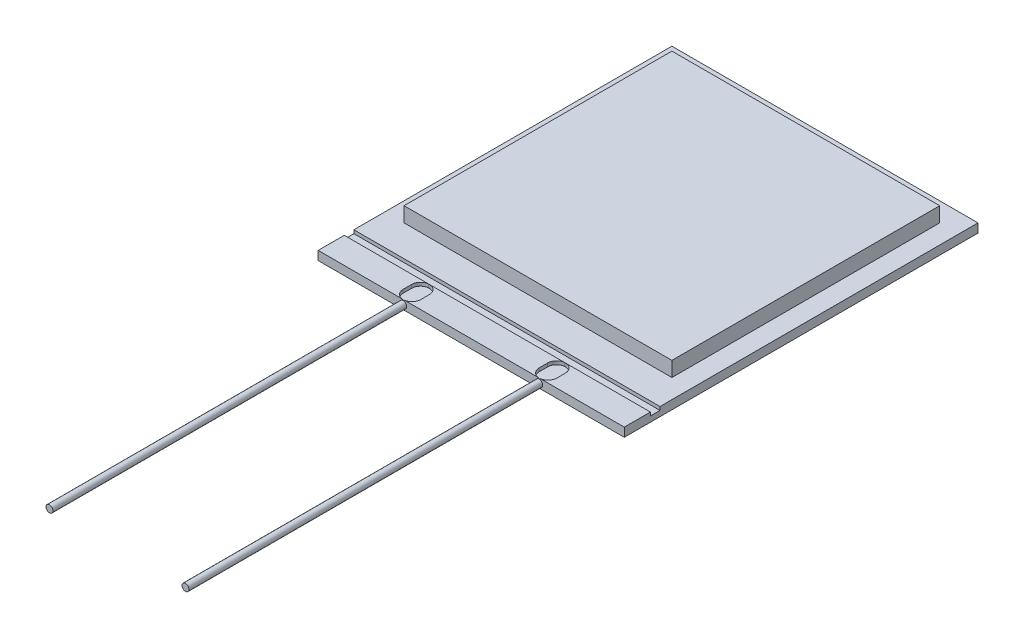
ISO-10303-21;
HEADER;
FILE_DESCRIPTION(('STEP AP214'),'2;1');
FILE_NAME('part.step','',(''),(''),'','','');
FILE_SCHEMA(('AUTOMOTIVE_DESIGN { 1 0 10303 214 1 1 1 1 }'));
ENDSEC;
DATA;
#1=APPLICATION_CONTEXT('core data for automotive mechanical design processes');
#2=APPLICATION_PROTOCOL_DEFINITION('international standard','automotive_design',2000,#1);
#3=PRODUCT_CONTEXT('',#1,'mechanical');
#4=PRODUCT('Part','Part','',(#3));
#5=PRODUCT_RELATED_PRODUCT_CATEGORY('part','',(#4));
#6=PRODUCT_DEFINITION_FORMATION('','',#4);
#7=PRODUCT_DEFINITION_CONTEXT('part definition',#1,'design');
#8=PRODUCT_DEFINITION('design','',#6,#7);
#9=PRODUCT_DEFINITION_SHAPE('','',#8);
#10=(LENGTH_UNIT() NAMED_UNIT(*) SI_UNIT(.MILLI.,.METRE.));
#11=(NAMED_UNIT(*) PLANE_ANGLE_UNIT() SI_UNIT($,.RADIAN.));
#12=(NAMED_UNIT(*) SI_UNIT($,.STERADIAN.) SOLID_ANGLE_UNIT());
#13=UNCERTAINTY_MEASURE_WITH_UNIT(LENGTH_MEASURE(1.E-05),#10,'distance_accuracy_value','');
#14=(GEOMETRIC_REPRESENTATION_CONTEXT(3) GLOBAL_UNCERTAINTY_ASSIGNED_CONTEXT((#13)) GLOBAL_UNIT_ASSIGNED_CONTEXT((#10,
#11,#12)) REPRESENTATION_CONTEXT('',''));
#15=CARTESIAN_POINT('',(0.,0.,0.));
#16=DIRECTION('',(0.,0.,1.));
#17=DIRECTION('',(1.,0.,0.));
#18=AXIS2_PLACEMENT_3D('',#15,#16,#17);
#19=CARTESIAN_POINT('',(5.715,0.3302,6.604));
#20=DIRECTION('',(0.,0.,-1.));
#21=DIRECTION('',(-1.,0.,0.));
#22=AXIS2_PLACEMENT_3D('',#19,#20,#21);
#23=PLANE('',#22);
#24=CARTESIAN_POINT('',(2.54,0.165099999999987,6.604));
#25=DIRECTION('',(0.,0.,1.));
#26=DIRECTION('',(-1.,0.,0.));
#27=AXIS2_PLACEMENT_3D('',#24,#25,#26);
#28=CIRCLE('',#27,0.129854710524441);
#29=CARTESIAN_POINT('',(2.51975239636126,0.293366442970371,6.604));
#30=VERTEX_POINT('',#29);
#31=CARTESIAN_POINT('',(2.56024760363874,0.293366442970371,6.604));
#32=VERTEX_POINT('',#31);
#33=EDGE_CURVE('E351',#30,#32,#28,.T.);
#34=ORIENTED_EDGE('',*,*,#33,.F.);
#35=DIRECTION('',(0.,1.,0.));
#36=VECTOR('',#35,1.);
#37=CARTESIAN_POINT('',(2.51975239636126,0.2032,6.604));
#38=LINE('',#37,#36);
#39=CARTESIAN_POINT('',(2.51975239636126,0.3302,6.604));
#40=VERTEX_POINT('',#39);
#41=EDGE_CURVE('E346',#30,#40,#38,.T.);
#42=ORIENTED_EDGE('',*,*,#41,.T.);
#43=DIRECTION('',(1.,0.,0.));
#44=VECTOR('',#43,1.);
#45=CARTESIAN_POINT('',(5.715,0.3302,6.604));
#46=LINE('',#45,#44);
#47=CARTESIAN_POINT('',(-2.51975239636126,0.3302,6.604));
#48=VERTEX_POINT('',#47);
#49=EDGE_CURVE('E364',#48,#40,#46,.T.);
#50=ORIENTED_EDGE('',*,*,#49,.F.);
#51=DIRECTION('',(0.,1.,0.));
#52=VECTOR('',#51,1.);
#53=CARTESIAN_POINT('',(-2.51975239636126,0.2032,6.604));
#54=LINE('',#53,#52);
#55=CARTESIAN_POINT('',(-2.51975239636126,0.293366442970384,6.604));
#56=VERTEX_POINT('',#55);
#57=EDGE_CURVE('E710',#56,#48,#54,.T.);
#58=ORIENTED_EDGE('',*,*,#57,.F.);
#59=CARTESIAN_POINT('',(-2.54,0.1651,6.604));
#60=DIRECTION('',(0.,0.,1.));
#61=DIRECTION('',(1.,0.,0.));
#62=AXIS2_PLACEMENT_3D('',#59,#60,#61);
#63=CIRCLE('',#62,0.129854710524441);
#64=CARTESIAN_POINT('',(-2.56024760363874,0.293366442970384,6.604));
#65=VERTEX_POINT('',#64);
#66=EDGE_CURVE('E13',#65,#56,#63,.T.);
#67=ORIENTED_EDGE('',*,*,#66,.F.);
#68=DIRECTION('',(0.,1.,0.));
#69=VECTOR('',#68,1.);
#70=CARTESIAN_POINT('',(-2.56024760363874,0.2032,6.604));
#71=LINE('',#70,#69);
#72=CARTESIAN_POINT('',(-2.56024760363874,0.3302,6.604));
#73=VERTEX_POINT('',#72);
#74=EDGE_CURVE('E345',#65,#73,#71,.T.);
#75=ORIENTED_EDGE('',*,*,#74,.T.);
#76=CARTESIAN_POINT('',(-5.715,0.3302,6.604));
#77=VERTEX_POINT('',#76);
#78=EDGE_CURVE('E495',#77,#73,#46,.T.);
#79=ORIENTED_EDGE('',*,*,#78,.F.);
#80=DIRECTION('',(0.,-1.,0.));
#81=VECTOR('',#80,1.);
#82=CARTESIAN_POINT('',(-5.715,0.3302,6.604));
#83=LINE('',#82,#81);
#84=CARTESIAN_POINT('',(-5.715,0.,6.604));
#85=VERTEX_POINT('',#84);
#86=EDGE_CURVE('E513',#77,#85,#83,.T.);
#87=ORIENTED_EDGE('',*,*,#86,.T.);
#88=DIRECTION('',(1.,0.,0.));
#89=VECTOR('',#88,1.);
#90=CARTESIAN_POINT('',(5.715,0.,6.604));
#91=LINE('',#90,#89);
#92=CARTESIAN_POINT('',(5.715,0.,6.604));
#93=VERTEX_POINT('',#92);
#94=EDGE_CURVE('E510',#85,#93,#91,.T.);
#95=ORIENTED_EDGE('',*,*,#94,.T.);
#96=DIRECTION('',(0.,-1.,0.));
#97=VECTOR('',#96,1.);
#98=CARTESIAN_POINT('',(5.715,0.3302,6.604));
#99=LINE('',#98,#97);
#100=CARTESIAN_POINT('',(5.715,0.3302,6.604));
#101=VERTEX_POINT('',#100);
#102=EDGE_CURVE('E451',#101,#93,#99,.T.);
#103=ORIENTED_EDGE('',*,*,#102,.F.);
#104=CARTESIAN_POINT('',(2.56024760363874,0.3302,6.604));
#105=VERTEX_POINT('',#104);
#106=EDGE_CURVE('E499',#105,#101,#46,.T.);
#107=ORIENTED_EDGE('',*,*,#106,.F.);
#108=DIRECTION('',(0.,1.,0.));
#109=VECTOR('',#108,1.);
#110=CARTESIAN_POINT('',(2.56024760363874,0.2032,6.604));
#111=LINE('',#110,#109);
#112=EDGE_CURVE('E358',#32,#105,#111,.T.);
#113=ORIENTED_EDGE('',*,*,#112,.F.);
#114=EDGE_LOOP('',(#34,#42,#50,#58,#67,#75,#79,#87,#95,#103,#107,#113));
#115=FACE_BOUND('',#114,.T.);
#116=ADVANCED_FACE('F141',(#115),#23,.F.);
#117=CARTESIAN_POINT('',(-5.715,0.3302,-6.604));
#118=DIRECTION('',(0.,1.,0.));
#119=DIRECTION('',(0.,0.,1.));
#120=AXIS2_PLACEMENT_3D('',#117,#118,#119);
#121=PLANE('',#120);
#122=DIRECTION('',(1.,0.,0.));
#123=VECTOR('',#122,1.);
#124=CARTESIAN_POINT('',(-13.7275605878218,0.3302,5.62864));
#125=LINE('',#124,#123);
#126=CARTESIAN_POINT('',(2.56511819770641,0.3302,5.62864));
#127=VERTEX_POINT('',#126);
#128=CARTESIAN_POINT('',(5.715,0.3302,5.62864));
#129=VERTEX_POINT('',#128);
#130=EDGE_CURVE('E389',#127,#129,#125,.T.);
#131=ORIENTED_EDGE('',*,*,#130,.F.);
#132=CARTESIAN_POINT('',(2.54,0.3302,5.95788324768168));
#133=DIRECTION('',(0.,1.,0.));
#134=DIRECTION('',(0.,0.,1.));
#135=AXIS2_PLACEMENT_3D('',#132,#133,#134);
#136=CIRCLE('',#135,0.3302);
#137=CARTESIAN_POINT('',(2.8702,0.3302,5.95788324768168));
#138=VERTEX_POINT('',#137);
#139=EDGE_CURVE('E561',#127,#138,#136,.F.);
#140=ORIENTED_EDGE('',*,*,#139,.T.);
#141=DIRECTION('',(0.,0.,-1.));
#142=VECTOR('',#141,1.);
#143=CARTESIAN_POINT('',(2.8702,0.3302,0.));
#144=LINE('',#143,#142);
#145=CARTESIAN_POINT('',(2.8702,0.3302,6.27442136818827));
#146=VERTEX_POINT('',#145);
#147=EDGE_CURVE('E570',#146,#138,#144,.T.);
#148=ORIENTED_EDGE('',*,*,#147,.F.);
#149=CARTESIAN_POINT('',(2.54,0.3302,6.27442136818827));
#150=DIRECTION('',(0.,1.,0.));
#151=DIRECTION('',(0.,0.,1.));
#152=AXIS2_PLACEMENT_3D('',#149,#150,#151);
#153=CIRCLE('',#152,0.3302);
#154=EDGE_CURVE('E366',#146,#105,#153,.F.);
#155=ORIENTED_EDGE('',*,*,#154,.T.);
#156=ORIENTED_EDGE('',*,*,#106,.T.);
#157=DIRECTION('',(0.,0.,-1.));
#158=VECTOR('',#157,1.);
#159=CARTESIAN_POINT('',(5.715,0.3302,6.604));
#160=LINE('',#159,#158);
#161=EDGE_CURVE('E500',#101,#129,#160,.T.);
#162=ORIENTED_EDGE('',*,*,#161,.T.);
#163=EDGE_LOOP('',(#131,#140,#148,#155,#156,#162));
#164=FACE_BOUND('',#163,.T.);
#165=ADVANCED_FACE('F602',(#164),#121,.T.);
#166=DIRECTION('',(0.,0.,-1.));
#167=VECTOR('',#166,1.);
#168=CARTESIAN_POINT('',(2.2098,0.3302,0.));
#169=LINE('',#168,#167);
#170=CARTESIAN_POINT('',(2.2098,0.3302,6.27442136818827));
#171=VERTEX_POINT('',#170);
#172=CARTESIAN_POINT('',(2.2098,0.3302,5.95788324768168));
#173=VERTEX_POINT('',#172);
#174=EDGE_CURVE('E503',#171,#173,#169,.T.);
#175=ORIENTED_EDGE('',*,*,#174,.T.);
#176=CARTESIAN_POINT('',(2.51488180229359,0.3302,5.62864));
#177=VERTEX_POINT('',#176);
#178=EDGE_CURVE('E558',#173,#177,#136,.F.);
#179=ORIENTED_EDGE('',*,*,#178,.T.);
#180=CARTESIAN_POINT('',(-2.51488180229358,0.3302,5.62864));
#181=VERTEX_POINT('',#180);
#182=EDGE_CURVE('E400',#181,#177,#125,.T.);
#183=ORIENTED_EDGE('',*,*,#182,.F.);
#184=CARTESIAN_POINT('',(-2.54,0.3302,5.95788324768168));
#185=DIRECTION('',(0.,1.,0.));
#186=DIRECTION('',(0.,0.,1.));
#187=AXIS2_PLACEMENT_3D('',#184,#185,#186);
#188=CIRCLE('',#187,0.3302);
#189=CARTESIAN_POINT('',(-2.2098,0.3302,5.95788324768168));
#190=VERTEX_POINT('',#189);
#191=EDGE_CURVE('E398',#190,#181,#188,.T.);
#192=ORIENTED_EDGE('',*,*,#191,.F.);
#193=DIRECTION('',(0.,0.,-1.));
#194=VECTOR('',#193,1.);
#195=CARTESIAN_POINT('',(-2.2098,0.3302,0.));
#196=LINE('',#195,#194);
#197=CARTESIAN_POINT('',(-2.2098,0.3302,6.27442136818827));
#198=VERTEX_POINT('',#197);
#199=EDGE_CURVE('E527',#198,#190,#196,.T.);
#200=ORIENTED_EDGE('',*,*,#199,.F.);
#201=CARTESIAN_POINT('',(-2.54,0.3302,6.27442136818827));
#202=DIRECTION('',(0.,1.,0.));
#203=DIRECTION('',(0.,0.,1.));
#204=AXIS2_PLACEMENT_3D('',#201,#202,#203);
#205=CIRCLE('',#204,0.3302);
#206=EDGE_CURVE('E711',#48,#198,#205,.T.);
#207=ORIENTED_EDGE('',*,*,#206,.F.);
#208=ORIENTED_EDGE('',*,*,#49,.T.);
#209=EDGE_CURVE('E362',#40,#171,#153,.F.);
#210=ORIENTED_EDGE('',*,*,#209,.T.);
#211=EDGE_LOOP('',(#175,#179,#183,#192,#200,#207,#208,#210));
#212=FACE_BOUND('',#211,.T.);
#213=ADVANCED_FACE('F607',(#212),#121,.T.);
#214=CARTESIAN_POINT('',(-2.8702,0.3302,6.27442136818827));
#215=VERTEX_POINT('',#214);
#216=EDGE_CURVE('E705',#215,#73,#205,.T.);
#217=ORIENTED_EDGE('',*,*,#216,.F.);
#218=DIRECTION('',(0.,0.,-1.));
#219=VECTOR('',#218,1.);
#220=CARTESIAN_POINT('',(-2.8702,0.3302,0.));
#221=LINE('',#220,#219);
#222=CARTESIAN_POINT('',(-2.8702,0.3302,5.95788324768168));
#223=VERTEX_POINT('',#222);
#224=EDGE_CURVE('E512',#215,#223,#221,.T.);
#225=ORIENTED_EDGE('',*,*,#224,.T.);
#226=CARTESIAN_POINT('',(-2.56511819770642,0.3302,5.62864));
#227=VERTEX_POINT('',#226);
#228=EDGE_CURVE('E399',#227,#223,#188,.T.);
#229=ORIENTED_EDGE('',*,*,#228,.F.);
#230=CARTESIAN_POINT('',(-5.715,0.3302,5.62864));
#231=VERTEX_POINT('',#230);
#232=EDGE_CURVE('E403',#231,#227,#125,.T.);
#233=ORIENTED_EDGE('',*,*,#232,.F.);
#234=DIRECTION('',(0.,0.,1.));
#235=VECTOR('',#234,1.);
#236=CARTESIAN_POINT('',(-5.715,0.3302,6.604));
#237=LINE('',#236,#235);
#238=EDGE_CURVE('E496',#231,#77,#237,.T.);
#239=ORIENTED_EDGE('',*,*,#238,.T.);
#240=ORIENTED_EDGE('',*,*,#78,.T.);
#241=EDGE_LOOP('',(#217,#225,#229,#233,#239,#240));
#242=FACE_BOUND('',#241,.T.);
#243=ADVANCED_FACE('F699',(#242),#121,.T.);
#244=DIRECTION('',(1.,0.,0.));
#245=VECTOR('',#244,1.);
#246=CARTESIAN_POINT('',(5.0000027,0.3302,4.1110027));
#247=LINE('',#246,#245);
#248=CARTESIAN_POINT('',(-5.0000027,0.3302,4.1110027));
#249=VERTEX_POINT('',#248);
#250=CARTESIAN_POINT('',(5.0000027,0.3302,4.1110027));
#251=VERTEX_POINT('',#250);
#252=EDGE_CURVE('E476',#249,#251,#247,.T.);
#253=ORIENTED_EDGE('',*,*,#252,.F.);
#254=DIRECTION('',(0.,0.,1.));
#255=VECTOR('',#254,1.);
#256=CARTESIAN_POINT('',(-5.0000027,0.3302,4.1110027));
#257=LINE('',#256,#255);
#258=CARTESIAN_POINT('',(-5.0000027,0.3302,-5.8890027));
#259=VERTEX_POINT('',#258);
#260=EDGE_CURVE('E471',#259,#249,#257,.T.);
#261=ORIENTED_EDGE('',*,*,#260,.F.);
#262=DIRECTION('',(-1.,0.,0.));
#263=VECTOR('',#262,1.);
#264=CARTESIAN_POINT('',(5.0000027,0.3302,-5.8890027));
#265=LINE('',#264,#263);
#266=CARTESIAN_POINT('',(5.0000027,0.3302,-5.8890027));
#267=VERTEX_POINT('',#266);
#268=EDGE_CURVE('E483',#267,#259,#265,.T.);
#269=ORIENTED_EDGE('',*,*,#268,.F.);
#270=DIRECTION('',(0.,0.,-1.));
#271=VECTOR('',#270,1.);
#272=CARTESIAN_POINT('',(5.0000027,0.3302,4.1110027));
#273=LINE('',#272,#271);
#274=EDGE_CURVE('E479',#251,#267,#273,.T.);
#275=ORIENTED_EDGE('',*,*,#274,.F.);
#276=EDGE_LOOP('',(#253,#261,#269,#275));
#277=FACE_BOUND('',#276,.T.);
#278=CARTESIAN_POINT('',(-5.715,0.3302,-6.604));
#279=VERTEX_POINT('',#278);
#280=CARTESIAN_POINT('',(-5.715,0.3302,5.2705));
#281=VERTEX_POINT('',#280);
#282=EDGE_CURVE('E492',#279,#281,#237,.T.);
#283=ORIENTED_EDGE('',*,*,#282,.T.);
#284=DIRECTION('',(1.,0.,0.));
#285=VECTOR('',#284,1.);
#286=CARTESIAN_POINT('',(-13.7275605878218,0.3302,5.2705));
#287=LINE('',#286,#285);
#288=CARTESIAN_POINT('',(5.715,0.3302,5.2705));
#289=VERTEX_POINT('',#288);
#290=EDGE_CURVE('E415',#281,#289,#287,.T.);
#291=ORIENTED_EDGE('',*,*,#290,.T.);
#292=CARTESIAN_POINT('',(5.715,0.3302,-6.604));
#293=VERTEX_POINT('',#292);
#294=EDGE_CURVE('E504',#289,#293,#160,.T.);
#295=ORIENTED_EDGE('',*,*,#294,.T.);
#296=DIRECTION('',(-1.,0.,0.));
#297=VECTOR('',#296,1.);
#298=CARTESIAN_POINT('',(5.715,0.3302,-6.604));
#299=LINE('',#298,#297);
#300=EDGE_CURVE('E452',#293,#279,#299,.T.);
#301=ORIENTED_EDGE('',*,*,#300,.T.);
#302=EDGE_LOOP('',(#283,#291,#295,#301));
#303=FACE_BOUND('',#302,.T.);
#304=ADVANCED_FACE('F610',(#277,#303),#121,.T.);
#305=CARTESIAN_POINT('',(5.715,0.3302,6.604));
#306=DIRECTION('',(-1.,0.,0.));
#307=DIRECTION('',(0.,0.,1.));
#308=AXIS2_PLACEMENT_3D('',#305,#306,#307);
#309=PLANE('',#308);
#310=DIRECTION('',(0.,1.,0.));
#311=VECTOR('',#310,1.);
#312=CARTESIAN_POINT('',(5.715,0.2032,5.2705));
#313=LINE('',#312,#311);
#314=CARTESIAN_POINT('',(5.715,0.2032,5.2705));
#315=VERTEX_POINT('',#314);
#316=EDGE_CURVE('E421',#315,#289,#313,.T.);
#317=ORIENTED_EDGE('',*,*,#316,.F.);
#318=DIRECTION('',(0.,0.,-1.));
#319=VECTOR('',#318,1.);
#320=CARTESIAN_POINT('',(5.715,0.2032,0.));
#321=LINE('',#320,#319);
#322=CARTESIAN_POINT('',(5.715,0.2032,5.62864));
#323=VERTEX_POINT('',#322);
#324=EDGE_CURVE('E425',#323,#315,#321,.T.);
#325=ORIENTED_EDGE('',*,*,#324,.F.);
#326=DIRECTION('',(0.,1.,0.));
#327=VECTOR('',#326,1.);
#328=CARTESIAN_POINT('',(5.715,0.2032,5.62864));
#329=LINE('',#328,#327);
#330=EDGE_CURVE('E449',#323,#129,#329,.T.);
#331=ORIENTED_EDGE('',*,*,#330,.T.);
#332=ORIENTED_EDGE('',*,*,#161,.F.);
#333=ORIENTED_EDGE('',*,*,#102,.T.);
#334=DIRECTION('',(0.,0.,-1.));
#335=VECTOR('',#334,1.);
#336=CARTESIAN_POINT('',(5.715,0.,6.604));
#337=LINE('',#336,#335);
#338=CARTESIAN_POINT('',(5.715,0.,-6.604));
#339=VERTEX_POINT('',#338);
#340=EDGE_CURVE('E447',#93,#339,#337,.T.);
#341=ORIENTED_EDGE('',*,*,#340,.T.);
#342=DIRECTION('',(0.,-1.,0.));
#343=VECTOR('',#342,1.);
#344=CARTESIAN_POINT('',(5.715,0.3302,-6.604));
#345=LINE('',#344,#343);
#346=EDGE_CURVE('E475',#293,#339,#345,.T.);
#347=ORIENTED_EDGE('',*,*,#346,.F.);
#348=ORIENTED_EDGE('',*,*,#294,.F.);
#349=EDGE_LOOP('',(#317,#325,#331,#332,#333,#341,#347,#348));
#350=FACE_BOUND('',#349,.T.);
#351=ADVANCED_FACE('F613',(#350),#309,.F.);
#352=CARTESIAN_POINT('',(-5.715,0.3302,6.604));
#353=DIRECTION('',(1.,0.,0.));
#354=DIRECTION('',(0.,0.,-1.));
#355=AXIS2_PLACEMENT_3D('',#352,#353,#354);
#356=PLANE('',#355);
#357=ORIENTED_EDGE('',*,*,#238,.F.);
#358=DIRECTION('',(0.,1.,0.));
#359=VECTOR('',#358,1.);
#360=CARTESIAN_POINT('',(-5.715,0.2032,5.62864));
#361=LINE('',#360,#359);
#362=CARTESIAN_POINT('',(-5.715,0.2032,5.62864));
#363=VERTEX_POINT('',#362);
#364=EDGE_CURVE('E406',#363,#231,#361,.T.);
#365=ORIENTED_EDGE('',*,*,#364,.F.);
#366=DIRECTION('',(0.,0.,1.));
#367=VECTOR('',#366,1.);
#368=CARTESIAN_POINT('',(-5.715,0.2032,0.));
#369=LINE('',#368,#367);
#370=CARTESIAN_POINT('',(-5.715,0.2032,5.2705));
#371=VERTEX_POINT('',#370);
#372=EDGE_CURVE('E413',#371,#363,#369,.T.);
#373=ORIENTED_EDGE('',*,*,#372,.F.);
#374=DIRECTION('',(0.,1.,0.));
#375=VECTOR('',#374,1.);
#376=CARTESIAN_POINT('',(-5.715,0.2032,5.2705));
#377=LINE('',#376,#375);
#378=EDGE_CURVE('E444',#371,#281,#377,.T.);
#379=ORIENTED_EDGE('',*,*,#378,.T.);
#380=ORIENTED_EDGE('',*,*,#282,.F.);
#381=DIRECTION('',(0.,-1.,0.));
#382=VECTOR('',#381,1.);
#383=CARTESIAN_POINT('',(-5.715,0.3302,-6.604));
#384=LINE('',#383,#382);
#385=CARTESIAN_POINT('',(-5.715,0.,-6.604));
#386=VERTEX_POINT('',#385);
#387=EDGE_CURVE('E446',#279,#386,#384,.T.);
#388=ORIENTED_EDGE('',*,*,#387,.T.);
#389=DIRECTION('',(0.,0.,1.));
#390=VECTOR('',#389,1.);
#391=CARTESIAN_POINT('',(-5.715,0.,6.604));
#392=LINE('',#391,#390);
#393=EDGE_CURVE('E506',#386,#85,#392,.T.);
#394=ORIENTED_EDGE('',*,*,#393,.T.);
#395=ORIENTED_EDGE('',*,*,#86,.F.);
#396=EDGE_LOOP('',(#357,#365,#373,#379,#380,#388,#394,#395));
#397=FACE_BOUND('',#396,.T.);
#398=ADVANCED_FACE('F615',(#397),#356,.F.);
#399=CARTESIAN_POINT('',(5.715,0.3302,-6.604));
#400=DIRECTION('',(0.,0.,1.));
#401=DIRECTION('',(1.,0.,0.));
#402=AXIS2_PLACEMENT_3D('',#399,#400,#401);
#403=PLANE('',#402);
#404=DIRECTION('',(-1.,0.,0.));
#405=VECTOR('',#404,1.);
#406=CARTESIAN_POINT('',(5.715,0.,-6.604));
#407=LINE('',#406,#405);
#408=EDGE_CURVE('E509',#339,#386,#407,.T.);
#409=ORIENTED_EDGE('',*,*,#408,.T.);
#410=ORIENTED_EDGE('',*,*,#387,.F.);
#411=ORIENTED_EDGE('',*,*,#300,.F.);
#412=ORIENTED_EDGE('',*,*,#346,.T.);
#413=EDGE_LOOP('',(#409,#410,#411,#412));
#414=FACE_BOUND('',#413,.T.);
#415=ADVANCED_FACE('F618',(#414),#403,.F.);
#416=CARTESIAN_POINT('',(-5.715,0.,-6.604));
#417=DIRECTION('',(0.,1.,0.));
#418=DIRECTION('',(0.,0.,1.));
#419=AXIS2_PLACEMENT_3D('',#416,#417,#418);
#420=PLANE('',#419);
#421=ORIENTED_EDGE('',*,*,#393,.F.);
#422=ORIENTED_EDGE('',*,*,#408,.F.);
#423=ORIENTED_EDGE('',*,*,#340,.F.);
#424=ORIENTED_EDGE('',*,*,#94,.F.);
#425=EDGE_LOOP('',(#421,#422,#423,#424));
#426=FACE_BOUND('',#425,.T.);
#427=ADVANCED_FACE('F674',(#426),#420,.F.);
#428=CARTESIAN_POINT('',(-5.0000027,0.885825,4.1110027));
#429=DIRECTION('',(1.,0.,0.));
#430=DIRECTION('',(0.,0.,-1.));
#431=AXIS2_PLACEMENT_3D('',#428,#429,#430);
#432=PLANE('',#431);
#433=ORIENTED_EDGE('',*,*,#260,.T.);
#434=DIRECTION('',(0.,-1.,0.));
#435=VECTOR('',#434,1.);
#436=CARTESIAN_POINT('',(-5.0000027,0.885825,4.1110027));
#437=LINE('',#436,#435);
#438=CARTESIAN_POINT('',(-5.0000027,0.885825,4.1110027));
#439=VERTEX_POINT('',#438);
#440=EDGE_CURVE('E478',#439,#249,#437,.T.);
#441=ORIENTED_EDGE('',*,*,#440,.F.);
#442=DIRECTION('',(0.,0.,1.));
#443=VECTOR('',#442,1.);
#444=CARTESIAN_POINT('',(-5.0000027,0.885825,4.1110027));
#445=LINE('',#444,#443);
#446=CARTESIAN_POINT('',(-5.0000027,0.885825,-5.8890027));
#447=VERTEX_POINT('',#446);
#448=EDGE_CURVE('E426',#447,#439,#445,.T.);
#449=ORIENTED_EDGE('',*,*,#448,.F.);
#450=DIRECTION('',(0.,-1.,0.));
#451=VECTOR('',#450,1.);
#452=CARTESIAN_POINT('',(-5.0000027,0.885825,-5.8890027));
#453=LINE('',#452,#451);
#454=EDGE_CURVE('E474',#447,#259,#453,.T.);
#455=ORIENTED_EDGE('',*,*,#454,.T.);
#456=EDGE_LOOP('',(#433,#441,#449,#455));
#457=FACE_BOUND('',#456,.T.);
#458=ADVANCED_FACE('F935',(#457),#432,.F.);
#459=CARTESIAN_POINT('',(5.0000027,0.885825,4.1110027));
#460=DIRECTION('',(0.,0.,-1.));
#461=DIRECTION('',(-1.,0.,0.));
#462=AXIS2_PLACEMENT_3D('',#459,#460,#461);
#463=PLANE('',#462);
#464=ORIENTED_EDGE('',*,*,#252,.T.);
#465=DIRECTION('',(0.,-1.,0.));
#466=VECTOR('',#465,1.);
#467=CARTESIAN_POINT('',(5.0000027,0.885825,4.1110027));
#468=LINE('',#467,#466);
#469=CARTESIAN_POINT('',(5.0000027,0.885825,4.1110027));
#470=VERTEX_POINT('',#469);
#471=EDGE_CURVE('E482',#470,#251,#468,.T.);
#472=ORIENTED_EDGE('',*,*,#471,.F.);
#473=DIRECTION('',(1.,0.,0.));
#474=VECTOR('',#473,1.);
#475=CARTESIAN_POINT('',(5.0000027,0.885825,4.1110027));
#476=LINE('',#475,#474);
#477=EDGE_CURVE('E468',#439,#470,#476,.T.);
#478=ORIENTED_EDGE('',*,*,#477,.F.);
#479=ORIENTED_EDGE('',*,*,#440,.T.);
#480=EDGE_LOOP('',(#464,#472,#478,#479));
#481=FACE_BOUND('',#480,.T.);
#482=ADVANCED_FACE('F925',(#481),#463,.F.);
#483=CARTESIAN_POINT('',(5.0000027,0.885825,4.1110027));
#484=DIRECTION('',(-1.,0.,0.));
#485=DIRECTION('',(0.,0.,1.));
#486=AXIS2_PLACEMENT_3D('',#483,#484,#485);
#487=PLANE('',#486);
#488=ORIENTED_EDGE('',*,*,#274,.T.);
#489=DIRECTION('',(0.,-1.,0.));
#490=VECTOR('',#489,1.);
#491=CARTESIAN_POINT('',(5.0000027,0.885825,-5.8890027));
#492=LINE('',#491,#490);
#493=CARTESIAN_POINT('',(5.0000027,0.885825,-5.8890027));
#494=VERTEX_POINT('',#493);
#495=EDGE_CURVE('E485',#494,#267,#492,.T.);
#496=ORIENTED_EDGE('',*,*,#495,.F.);
#497=DIRECTION('',(0.,0.,-1.));
#498=VECTOR('',#497,1.);
#499=CARTESIAN_POINT('',(5.0000027,0.885825,4.1110027));
#500=LINE('',#499,#498);
#501=EDGE_CURVE('E462',#470,#494,#500,.T.);
#502=ORIENTED_EDGE('',*,*,#501,.F.);
#503=ORIENTED_EDGE('',*,*,#471,.T.);
#504=EDGE_LOOP('',(#488,#496,#502,#503));
#505=FACE_BOUND('',#504,.T.);
#506=ADVANCED_FACE('F915',(#505),#487,.F.);
#507=CARTESIAN_POINT('',(5.0000027,0.885825,-5.8890027));
#508=DIRECTION('',(0.,0.,1.));
#509=DIRECTION('',(1.,0.,0.));
#510=AXIS2_PLACEMENT_3D('',#507,#508,#509);
#511=PLANE('',#510);
#512=ORIENTED_EDGE('',*,*,#268,.T.);
#513=ORIENTED_EDGE('',*,*,#454,.F.);
#514=DIRECTION('',(-1.,0.,0.));
#515=VECTOR('',#514,1.);
#516=CARTESIAN_POINT('',(5.0000027,0.885825,-5.8890027));
#517=LINE('',#516,#515);
#518=EDGE_CURVE('E459',#494,#447,#517,.T.);
#519=ORIENTED_EDGE('',*,*,#518,.F.);
#520=ORIENTED_EDGE('',*,*,#495,.T.);
#521=EDGE_LOOP('',(#512,#513,#519,#520));
#522=FACE_BOUND('',#521,.T.);
#523=ADVANCED_FACE('F651',(#522),#511,.F.);
#524=CARTESIAN_POINT('',(-5.0000027,0.885825,-5.8890027));
#525=DIRECTION('',(0.,1.,0.));
#526=DIRECTION('',(0.,0.,1.));
#527=AXIS2_PLACEMENT_3D('',#524,#525,#526);
#528=PLANE('',#527);
#529=ORIENTED_EDGE('',*,*,#448,.T.);
#530=ORIENTED_EDGE('',*,*,#477,.T.);
#531=ORIENTED_EDGE('',*,*,#501,.T.);
#532=ORIENTED_EDGE('',*,*,#518,.T.);
#533=EDGE_LOOP('',(#529,#530,#531,#532));
#534=FACE_BOUND('',#533,.T.);
#535=ADVANCED_FACE('F643',(#534),#528,.T.);
#536=CARTESIAN_POINT('',(-13.7275605878218,0.2032,5.62864));
#537=DIRECTION('',(0.,0.,1.));
#538=DIRECTION('',(1.,0.,0.));
#539=AXIS2_PLACEMENT_3D('',#536,#537,#538);
#540=PLANE('',#539);
#541=ORIENTED_EDGE('',*,*,#182,.T.);
#542=DIRECTION('',(0.,1.,0.));
#543=VECTOR('',#542,1.);
#544=CARTESIAN_POINT('',(2.51488180229359,0.2032,5.62864));
#545=LINE('',#544,#543);
#546=CARTESIAN_POINT('',(2.51488180229359,0.2032,5.62864));
#547=VERTEX_POINT('',#546);
#548=EDGE_CURVE('E150',#547,#177,#545,.T.);
#549=ORIENTED_EDGE('',*,*,#548,.F.);
#550=DIRECTION('',(1.,0.,0.));
#551=VECTOR('',#550,1.);
#552=CARTESIAN_POINT('',(-13.7275605878218,0.2032,5.62864));
#553=LINE('',#552,#551);
#554=CARTESIAN_POINT('',(-2.51488180229358,0.2032,5.62864));
#555=VERTEX_POINT('',#554);
#556=EDGE_CURVE('E388',#555,#547,#553,.T.);
#557=ORIENTED_EDGE('',*,*,#556,.F.);
#558=DIRECTION('',(0.,1.,0.));
#559=VECTOR('',#558,1.);
#560=CARTESIAN_POINT('',(-2.51488180229358,0.2032,5.62864));
#561=LINE('',#560,#559);
#562=EDGE_CURVE('E407',#555,#181,#561,.T.);
#563=ORIENTED_EDGE('',*,*,#562,.T.);
#564=EDGE_LOOP('',(#541,#549,#557,#563));
#565=FACE_BOUND('',#564,.T.);
#566=ADVANCED_FACE('F640',(#565),#540,.F.);
#567=ORIENTED_EDGE('',*,*,#232,.T.);
#568=DIRECTION('',(0.,1.,0.));
#569=VECTOR('',#568,1.);
#570=CARTESIAN_POINT('',(-2.56511819770642,0.2032,5.62864));
#571=LINE('',#570,#569);
#572=CARTESIAN_POINT('',(-2.56511819770642,0.2032,5.62864));
#573=VERTEX_POINT('',#572);
#574=EDGE_CURVE('E395',#573,#227,#571,.T.);
#575=ORIENTED_EDGE('',*,*,#574,.F.);
#576=EDGE_CURVE('E422',#363,#573,#553,.T.);
#577=ORIENTED_EDGE('',*,*,#576,.F.);
#578=ORIENTED_EDGE('',*,*,#364,.T.);
#579=EDGE_LOOP('',(#567,#575,#577,#578));
#580=FACE_BOUND('',#579,.T.);
#581=ADVANCED_FACE('F642',(#580),#540,.F.);
#582=CARTESIAN_POINT('',(-13.7275605878218,0.2032,5.2705));
#583=DIRECTION('',(0.,0.,1.));
#584=DIRECTION('',(1.,0.,0.));
#585=AXIS2_PLACEMENT_3D('',#582,#583,#584);
#586=PLANE('',#585);
#587=ORIENTED_EDGE('',*,*,#290,.F.);
#588=ORIENTED_EDGE('',*,*,#378,.F.);
#589=DIRECTION('',(1.,0.,0.));
#590=VECTOR('',#589,1.);
#591=CARTESIAN_POINT('',(-13.7275605878218,0.2032,5.2705));
#592=LINE('',#591,#590);
#593=EDGE_CURVE('E436',#371,#315,#592,.T.);
#594=ORIENTED_EDGE('',*,*,#593,.T.);
#595=ORIENTED_EDGE('',*,*,#316,.T.);
#596=EDGE_LOOP('',(#587,#588,#594,#595));
#597=FACE_BOUND('',#596,.T.);
#598=ADVANCED_FACE('F650',(#597),#586,.T.);
#599=ORIENTED_EDGE('',*,*,#130,.T.);
#600=ORIENTED_EDGE('',*,*,#330,.F.);
#601=CARTESIAN_POINT('',(2.56511819770641,0.2032,5.62864));
#602=VERTEX_POINT('',#601);
#603=EDGE_CURVE('E423',#602,#323,#553,.T.);
#604=ORIENTED_EDGE('',*,*,#603,.F.);
#605=DIRECTION('',(0.,1.,0.));
#606=VECTOR('',#605,1.);
#607=CARTESIAN_POINT('',(2.56511819770641,0.2032,5.62864));
#608=LINE('',#607,#606);
#609=EDGE_CURVE('E385',#602,#127,#608,.T.);
#610=ORIENTED_EDGE('',*,*,#609,.T.);
#611=EDGE_LOOP('',(#599,#600,#604,#610));
#612=FACE_BOUND('',#611,.T.);
#613=ADVANCED_FACE('F645',(#612),#540,.F.);
#614=CARTESIAN_POINT('',(-13.7275605878218,0.2032,0.));
#615=DIRECTION('',(0.,1.,0.));
#616=DIRECTION('',(0.,0.,1.));
#617=AXIS2_PLACEMENT_3D('',#614,#615,#616);
#618=PLANE('',#617);
#619=ORIENTED_EDGE('',*,*,#556,.T.);
#620=CARTESIAN_POINT('',(2.54,0.2032,5.95788324768168));
#621=DIRECTION('',(0.,1.,0.));
#622=DIRECTION('',(0.,0.,1.));
#623=AXIS2_PLACEMENT_3D('',#620,#621,#622);
#624=CIRCLE('',#623,0.3302);
#625=CARTESIAN_POINT('',(2.2098,0.2032,5.95788324768168));
#626=VERTEX_POINT('',#625);
#627=EDGE_CURVE('E381',#626,#547,#624,.F.);
#628=ORIENTED_EDGE('',*,*,#627,.F.);
#629=DIRECTION('',(0.,0.,-1.));
#630=VECTOR('',#629,1.);
#631=CARTESIAN_POINT('',(2.2098,0.2032,0.));
#632=LINE('',#631,#630);
#633=CARTESIAN_POINT('',(2.2098,0.2032,6.27442136818827));
#634=VERTEX_POINT('',#633);
#635=EDGE_CURVE('E376',#634,#626,#632,.T.);
#636=ORIENTED_EDGE('',*,*,#635,.F.);
#637=CARTESIAN_POINT('',(2.54,0.2032,6.27442136818827));
#638=DIRECTION('',(0.,1.,0.));
#639=DIRECTION('',(0.,0.,1.));
#640=AXIS2_PLACEMENT_3D('',#637,#638,#639);
#641=CIRCLE('',#640,0.3302);
#642=CARTESIAN_POINT('',(2.51975239636126,0.2032,6.604));
#643=VERTEX_POINT('',#642);
#644=EDGE_CURVE('E374',#643,#634,#641,.F.);
#645=ORIENTED_EDGE('',*,*,#644,.F.);
#646=DIRECTION('',(1.,0.,0.));
#647=VECTOR('',#646,1.);
#648=CARTESIAN_POINT('',(-13.7275605878218,0.2032,6.604));
#649=LINE('',#648,#647);
#650=CARTESIAN_POINT('',(2.56024760363874,0.2032,6.604));
#651=VERTEX_POINT('',#650);
#652=EDGE_CURVE('E341',#643,#651,#649,.T.);
#653=ORIENTED_EDGE('',*,*,#652,.T.);
#654=CARTESIAN_POINT('',(2.8702,0.2032,6.27442136818827));
#655=VERTEX_POINT('',#654);
#656=EDGE_CURVE('E373',#655,#651,#641,.F.);
#657=ORIENTED_EDGE('',*,*,#656,.F.);
#658=DIRECTION('',(0.,0.,-1.));
#659=VECTOR('',#658,1.);
#660=CARTESIAN_POINT('',(2.8702,0.2032,0.));
#661=LINE('',#660,#659);
#662=CARTESIAN_POINT('',(2.8702,0.2032,5.95788324768168));
#663=VERTEX_POINT('',#662);
#664=EDGE_CURVE('E565',#655,#663,#661,.T.);
#665=ORIENTED_EDGE('',*,*,#664,.T.);
#666=EDGE_CURVE('E382',#602,#663,#624,.F.);
#667=ORIENTED_EDGE('',*,*,#666,.F.);
#668=ORIENTED_EDGE('',*,*,#603,.T.);
#669=ORIENTED_EDGE('',*,*,#324,.T.);
#670=ORIENTED_EDGE('',*,*,#593,.F.);
#671=ORIENTED_EDGE('',*,*,#372,.T.);
#672=ORIENTED_EDGE('',*,*,#576,.T.);
#673=CARTESIAN_POINT('',(-2.54,0.2032,5.95788324768168));
#674=DIRECTION('',(0.,1.,0.));
#675=DIRECTION('',(0.,0.,1.));
#676=AXIS2_PLACEMENT_3D('',#673,#674,#675);
#677=CIRCLE('',#676,0.3302);
#678=CARTESIAN_POINT('',(-2.8702,0.2032,5.95788324768168));
#679=VERTEX_POINT('',#678);
#680=EDGE_CURVE('E528',#573,#679,#677,.T.);
#681=ORIENTED_EDGE('',*,*,#680,.T.);
#682=DIRECTION('',(0.,0.,-1.));
#683=VECTOR('',#682,1.);
#684=CARTESIAN_POINT('',(-2.8702,0.2032,0.));
#685=LINE('',#684,#683);
#686=CARTESIAN_POINT('',(-2.8702,0.2032,6.27442136818827));
#687=VERTEX_POINT('',#686);
#688=EDGE_CURVE('E532',#687,#679,#685,.T.);
#689=ORIENTED_EDGE('',*,*,#688,.F.);
#690=CARTESIAN_POINT('',(-2.54,0.2032,6.27442136818827));
#691=DIRECTION('',(0.,1.,0.));
#692=DIRECTION('',(0.,0.,1.));
#693=AXIS2_PLACEMENT_3D('',#690,#691,#692);
#694=CIRCLE('',#693,0.3302);
#695=CARTESIAN_POINT('',(-2.56024760363874,0.2032,6.604));
#696=VERTEX_POINT('',#695);
#697=EDGE_CURVE('E537',#687,#696,#694,.T.);
#698=ORIENTED_EDGE('',*,*,#697,.T.);
#699=DIRECTION('',(1.,0.,0.));
#700=VECTOR('',#699,1.);
#701=CARTESIAN_POINT('',(-13.7275605878218,0.2032,6.604));
#702=LINE('',#701,#700);
#703=CARTESIAN_POINT('',(-2.51975239636126,0.2032,6.604));
#704=VERTEX_POINT('',#703);
#705=EDGE_CURVE('E540',#696,#704,#702,.T.);
#706=ORIENTED_EDGE('',*,*,#705,.T.);
#707=CARTESIAN_POINT('',(-2.2098,0.2032,6.27442136818827));
#708=VERTEX_POINT('',#707);
#709=EDGE_CURVE('E541',#704,#708,#694,.T.);
#710=ORIENTED_EDGE('',*,*,#709,.T.);
#711=DIRECTION('',(0.,0.,-1.));
#712=VECTOR('',#711,1.);
#713=CARTESIAN_POINT('',(-2.2098,0.2032,0.));
#714=LINE('',#713,#712);
#715=CARTESIAN_POINT('',(-2.2098,0.2032,5.95788324768168));
#716=VERTEX_POINT('',#715);
#717=EDGE_CURVE('E431',#708,#716,#714,.T.);
#718=ORIENTED_EDGE('',*,*,#717,.T.);
#719=EDGE_CURVE('E525',#716,#555,#677,.T.);
#720=ORIENTED_EDGE('',*,*,#719,.T.);
#721=EDGE_LOOP('',(#619,#628,#636,#645,#653,#657,#665,#667,#668,#669,#670,#671,#672,#681,#689,
#698,#706,#710,#718,#720));
#722=FACE_BOUND('',#721,.T.);
#723=ADVANCED_FACE('F589',(#722),#618,.T.);
#724=CARTESIAN_POINT('',(-2.2098,0.2032,0.));
#725=DIRECTION('',(1.,0.,0.));
#726=DIRECTION('',(0.,0.,-1.));
#727=AXIS2_PLACEMENT_3D('',#724,#725,#726);
#728=PLANE('',#727);
#729=ORIENTED_EDGE('',*,*,#199,.T.);
#730=DIRECTION('',(0.,1.,0.));
#731=VECTOR('',#730,1.);
#732=CARTESIAN_POINT('',(-2.2098,0.2032,5.95788324768168));
#733=LINE('',#732,#731);
#734=EDGE_CURVE('E551',#716,#190,#733,.T.);
#735=ORIENTED_EDGE('',*,*,#734,.F.);
#736=ORIENTED_EDGE('',*,*,#717,.F.);
#737=DIRECTION('',(0.,1.,0.));
#738=VECTOR('',#737,1.);
#739=CARTESIAN_POINT('',(-2.2098,0.2032,6.27442136818827));
#740=LINE('',#739,#738);
#741=EDGE_CURVE('E545',#708,#198,#740,.T.);
#742=ORIENTED_EDGE('',*,*,#741,.T.);
#743=EDGE_LOOP('',(#729,#735,#736,#742));
#744=FACE_BOUND('',#743,.T.);
#745=ADVANCED_FACE('F661',(#744),#728,.F.);
#746=CARTESIAN_POINT('',(-2.54,0.2032,6.27442136818827));
#747=DIRECTION('',(0.,1.,0.));
#748=DIRECTION('',(0.,0.,1.));
#749=AXIS2_PLACEMENT_3D('',#746,#747,#748);
#750=CYLINDRICAL_SURFACE('',#749,0.3302);
#751=ORIENTED_EDGE('',*,*,#206,.T.);
#752=ORIENTED_EDGE('',*,*,#741,.F.);
#753=ORIENTED_EDGE('',*,*,#709,.F.);
#754=EDGE_CURVE('E708',#704,#56,#54,.T.);
#755=ORIENTED_EDGE('',*,*,#754,.T.);
#756=ORIENTED_EDGE('',*,*,#57,.T.);
#757=EDGE_LOOP('',(#751,#752,#753,#755,#756));
#758=FACE_BOUND('',#757,.T.);
#759=ADVANCED_FACE('F718',(#758),#750,.F.);
#760=ORIENTED_EDGE('',*,*,#216,.T.);
#761=ORIENTED_EDGE('',*,*,#74,.F.);
#762=EDGE_CURVE('E524',#696,#65,#71,.T.);
#763=ORIENTED_EDGE('',*,*,#762,.F.);
#764=ORIENTED_EDGE('',*,*,#697,.F.);
#765=DIRECTION('',(0.,1.,0.));
#766=VECTOR('',#765,1.);
#767=CARTESIAN_POINT('',(-2.8702,0.2032,6.27442136818827));
#768=LINE('',#767,#766);
#769=EDGE_CURVE('E536',#687,#215,#768,.T.);
#770=ORIENTED_EDGE('',*,*,#769,.T.);
#771=EDGE_LOOP('',(#760,#761,#763,#764,#770));
#772=FACE_BOUND('',#771,.T.);
#773=ADVANCED_FACE('F763',(#772),#750,.F.);
#774=CARTESIAN_POINT('',(-2.8702,0.2032,0.));
#775=DIRECTION('',(1.,0.,0.));
#776=DIRECTION('',(0.,0.,-1.));
#777=AXIS2_PLACEMENT_3D('',#774,#775,#776);
#778=PLANE('',#777);
#779=ORIENTED_EDGE('',*,*,#224,.F.);
#780=ORIENTED_EDGE('',*,*,#769,.F.);
#781=ORIENTED_EDGE('',*,*,#688,.T.);
#782=DIRECTION('',(0.,1.,0.));
#783=VECTOR('',#782,1.);
#784=CARTESIAN_POINT('',(-2.8702,0.2032,5.95788324768168));
#785=LINE('',#784,#783);
#786=EDGE_CURVE('E535',#679,#223,#785,.T.);
#787=ORIENTED_EDGE('',*,*,#786,.T.);
#788=EDGE_LOOP('',(#779,#780,#781,#787));
#789=FACE_BOUND('',#788,.T.);
#790=ADVANCED_FACE('F760',(#789),#778,.T.);
#791=CARTESIAN_POINT('',(-2.54,0.2032,5.95788324768168));
#792=DIRECTION('',(0.,1.,0.));
#793=DIRECTION('',(0.,0.,1.));
#794=AXIS2_PLACEMENT_3D('',#791,#792,#793);
#795=CYLINDRICAL_SURFACE('',#794,0.3302);
#796=ORIENTED_EDGE('',*,*,#228,.T.);
#797=ORIENTED_EDGE('',*,*,#786,.F.);
#798=ORIENTED_EDGE('',*,*,#680,.F.);
#799=ORIENTED_EDGE('',*,*,#574,.T.);
#800=EDGE_LOOP('',(#796,#797,#798,#799));
#801=FACE_BOUND('',#800,.T.);
#802=ADVANCED_FACE('F694',(#801),#795,.F.);
#803=ORIENTED_EDGE('',*,*,#191,.T.);
#804=ORIENTED_EDGE('',*,*,#562,.F.);
#805=ORIENTED_EDGE('',*,*,#719,.F.);
#806=ORIENTED_EDGE('',*,*,#734,.T.);
#807=EDGE_LOOP('',(#803,#804,#805,#806));
#808=FACE_BOUND('',#807,.T.);
#809=ADVANCED_FACE('F759',(#808),#795,.F.);
#810=CARTESIAN_POINT('',(2.2098,0.2032,0.));
#811=DIRECTION('',(1.,0.,0.));
#812=DIRECTION('',(0.,0.,-1.));
#813=AXIS2_PLACEMENT_3D('',#810,#811,#812);
#814=PLANE('',#813);
#815=ORIENTED_EDGE('',*,*,#174,.F.);
#816=DIRECTION('',(0.,1.,0.));
#817=VECTOR('',#816,1.);
#818=CARTESIAN_POINT('',(2.2098,0.2032,6.27442136818827));
#819=LINE('',#818,#817);
#820=EDGE_CURVE('E371',#634,#171,#819,.T.);
#821=ORIENTED_EDGE('',*,*,#820,.F.);
#822=ORIENTED_EDGE('',*,*,#635,.T.);
#823=DIRECTION('',(0.,1.,0.));
#824=VECTOR('',#823,1.);
#825=CARTESIAN_POINT('',(2.2098,0.2032,5.95788324768168));
#826=LINE('',#825,#824);
#827=EDGE_CURVE('E375',#626,#173,#826,.T.);
#828=ORIENTED_EDGE('',*,*,#827,.T.);
#829=EDGE_LOOP('',(#815,#821,#822,#828));
#830=FACE_BOUND('',#829,.T.);
#831=ADVANCED_FACE('F143',(#830),#814,.T.);
#832=CARTESIAN_POINT('',(2.54,0.2032,6.27442136818827));
#833=DIRECTION('',(0.,1.,0.));
#834=DIRECTION('',(0.,0.,1.));
#835=AXIS2_PLACEMENT_3D('',#832,#833,#834);
#836=CYLINDRICAL_SURFACE('',#835,0.3302);
#837=ORIENTED_EDGE('',*,*,#209,.F.);
#838=ORIENTED_EDGE('',*,*,#41,.F.);
#839=EDGE_CURVE('E338',#643,#30,#38,.T.);
#840=ORIENTED_EDGE('',*,*,#839,.F.);
#841=ORIENTED_EDGE('',*,*,#644,.T.);
#842=ORIENTED_EDGE('',*,*,#820,.T.);
#843=EDGE_LOOP('',(#837,#838,#840,#841,#842));
#844=FACE_BOUND('',#843,.T.);
#845=ADVANCED_FACE('F360',(#844),#836,.F.);
#846=ORIENTED_EDGE('',*,*,#154,.F.);
#847=DIRECTION('',(0.,1.,0.));
#848=VECTOR('',#847,1.);
#849=CARTESIAN_POINT('',(2.8702,0.2032,6.27442136818827));
#850=LINE('',#849,#848);
#851=EDGE_CURVE('E573',#655,#146,#850,.T.);
#852=ORIENTED_EDGE('',*,*,#851,.F.);
#853=ORIENTED_EDGE('',*,*,#656,.T.);
#854=EDGE_CURVE('E369',#651,#32,#111,.T.);
#855=ORIENTED_EDGE('',*,*,#854,.T.);
#856=ORIENTED_EDGE('',*,*,#112,.T.);
#857=EDGE_LOOP('',(#846,#852,#853,#855,#856));
#858=FACE_BOUND('',#857,.T.);
#859=ADVANCED_FACE('F594',(#858),#836,.F.);
#860=CARTESIAN_POINT('',(2.8702,0.2032,0.));
#861=DIRECTION('',(1.,0.,0.));
#862=DIRECTION('',(0.,0.,-1.));
#863=AXIS2_PLACEMENT_3D('',#860,#861,#862);
#864=PLANE('',#863);
#865=ORIENTED_EDGE('',*,*,#147,.T.);
#866=DIRECTION('',(0.,1.,0.));
#867=VECTOR('',#866,1.);
#868=CARTESIAN_POINT('',(2.8702,0.2032,5.95788324768168));
#869=LINE('',#868,#867);
#870=EDGE_CURVE('E557',#663,#138,#869,.T.);
#871=ORIENTED_EDGE('',*,*,#870,.F.);
#872=ORIENTED_EDGE('',*,*,#664,.F.);
#873=ORIENTED_EDGE('',*,*,#851,.T.);
#874=EDGE_LOOP('',(#865,#871,#872,#873));
#875=FACE_BOUND('',#874,.T.);
#876=ADVANCED_FACE('F584',(#875),#864,.F.);
#877=CARTESIAN_POINT('',(2.54,0.2032,5.95788324768168));
#878=DIRECTION('',(0.,1.,0.));
#879=DIRECTION('',(0.,0.,1.));
#880=AXIS2_PLACEMENT_3D('',#877,#878,#879);
#881=CYLINDRICAL_SURFACE('',#880,0.3302);
#882=ORIENTED_EDGE('',*,*,#139,.F.);
#883=ORIENTED_EDGE('',*,*,#609,.F.);
#884=ORIENTED_EDGE('',*,*,#666,.T.);
#885=ORIENTED_EDGE('',*,*,#870,.T.);
#886=EDGE_LOOP('',(#882,#883,#884,#885));
#887=FACE_BOUND('',#886,.T.);
#888=ADVANCED_FACE('F580',(#887),#881,.F.);
#889=ORIENTED_EDGE('',*,*,#178,.F.);
#890=ORIENTED_EDGE('',*,*,#827,.F.);
#891=ORIENTED_EDGE('',*,*,#627,.T.);
#892=ORIENTED_EDGE('',*,*,#548,.T.);
#893=EDGE_LOOP('',(#889,#890,#891,#892));
#894=FACE_BOUND('',#893,.T.);
#895=ADVANCED_FACE('F621',(#894),#881,.F.);
#896=CARTESIAN_POINT('',(-2.54,0.1651,19.812));
#897=DIRECTION('',(0.,0.,-1.));
#898=DIRECTION('',(-1.,0.,0.));
#899=AXIS2_PLACEMENT_3D('',#896,#897,#898);
#900=CYLINDRICAL_SURFACE('',#899,0.129854710524441);
#901=CARTESIAN_POINT('',(-2.54,0.1651,19.812));
#902=DIRECTION('',(0.,0.,1.));
#903=DIRECTION('',(1.,0.,0.));
#904=AXIS2_PLACEMENT_3D('',#901,#902,#903);
#905=CIRCLE('',#904,0.129854710524441);
#906=CARTESIAN_POINT('',(-2.41014528947556,0.1651,19.812));
#907=VERTEX_POINT('',#906);
#908=EDGE_CURVE('E733',#907,#907,#905,.T.);
#909=ORIENTED_EDGE('',*,*,#908,.F.);
#910=EDGE_LOOP('',(#909));
#911=FACE_BOUND('',#910,.T.);
#912=EDGE_CURVE('E152',#56,#65,#63,.T.);
#913=ORIENTED_EDGE('',*,*,#912,.T.);
#914=ORIENTED_EDGE('',*,*,#66,.T.);
#915=EDGE_LOOP('',(#913,#914));
#916=FACE_BOUND('',#915,.T.);
#917=ADVANCED_FACE('F625',(#911,#916),#900,.T.);
#918=CARTESIAN_POINT('',(-2.54,0.1651,19.812));
#919=DIRECTION('',(0.,0.,1.));
#920=DIRECTION('',(1.,0.,0.));
#921=AXIS2_PLACEMENT_3D('',#918,#919,#920);
#922=PLANE('',#921);
#923=ORIENTED_EDGE('',*,*,#908,.T.);
#924=EDGE_LOOP('',(#923));
#925=FACE_BOUND('',#924,.T.);
#926=ADVANCED_FACE('F630',(#925),#922,.T.);
#927=CARTESIAN_POINT('',(-2.54,0.1651,6.604));
#928=DIRECTION('',(0.,0.,1.));
#929=DIRECTION('',(1.,0.,0.));
#930=AXIS2_PLACEMENT_3D('',#927,#928,#929);
#931=PLANE('',#930);
#932=ORIENTED_EDGE('',*,*,#754,.F.);
#933=ORIENTED_EDGE('',*,*,#705,.F.);
#934=ORIENTED_EDGE('',*,*,#762,.T.);
#935=ORIENTED_EDGE('',*,*,#912,.F.);
#936=EDGE_LOOP('',(#932,#933,#934,#935));
#937=FACE_BOUND('',#936,.T.);
#938=ADVANCED_FACE('F730',(#937),#931,.F.);
#939=CARTESIAN_POINT('',(2.54,0.165099999999987,19.812));
#940=DIRECTION('',(0.,0.,-1.));
#941=DIRECTION('',(-1.,0.,0.));
#942=AXIS2_PLACEMENT_3D('',#939,#940,#941);
#943=CYLINDRICAL_SURFACE('',#942,0.129854710524441);
#944=CARTESIAN_POINT('',(2.54,0.165099999999987,19.812));
#945=DIRECTION('',(0.,0.,1.));
#946=DIRECTION('',(-1.,0.,0.));
#947=AXIS2_PLACEMENT_3D('',#944,#945,#946);
#948=CIRCLE('',#947,0.129854710524441);
#949=CARTESIAN_POINT('',(2.41014528947556,0.165099999999987,19.812));
#950=VERTEX_POINT('',#949);
#951=EDGE_CURVE('E353',#950,#950,#948,.T.);
#952=ORIENTED_EDGE('',*,*,#951,.F.);
#953=EDGE_LOOP('',(#952));
#954=FACE_BOUND('',#953,.T.);
#955=EDGE_CURVE('E159',#32,#30,#28,.T.);
#956=ORIENTED_EDGE('',*,*,#955,.T.);
#957=ORIENTED_EDGE('',*,*,#33,.T.);
#958=EDGE_LOOP('',(#956,#957));
#959=FACE_BOUND('',#958,.T.);
#960=ADVANCED_FACE('F350',(#954,#959),#943,.T.);
#961=CARTESIAN_POINT('',(2.54,0.165099999999987,19.812));
#962=DIRECTION('',(0.,0.,-1.));
#963=DIRECTION('',(-1.,0.,0.));
#964=AXIS2_PLACEMENT_3D('',#961,#962,#963);
#965=PLANE('',#964);
#966=ORIENTED_EDGE('',*,*,#951,.T.);
#967=EDGE_LOOP('',(#966));
#968=FACE_BOUND('',#967,.T.);
#969=ADVANCED_FACE('F740',(#968),#965,.F.);
#970=CARTESIAN_POINT('',(2.54,0.165099999999987,6.604));
#971=DIRECTION('',(0.,0.,-1.));
#972=DIRECTION('',(-1.,0.,0.));
#973=AXIS2_PLACEMENT_3D('',#970,#971,#972);
#974=PLANE('',#973);
#975=ORIENTED_EDGE('',*,*,#652,.F.);
#976=ORIENTED_EDGE('',*,*,#839,.T.);
#977=ORIENTED_EDGE('',*,*,#955,.F.);
#978=ORIENTED_EDGE('',*,*,#854,.F.);
#979=EDGE_LOOP('',(#975,#976,#977,#978));
#980=FACE_BOUND('',#979,.T.);
#981=ADVANCED_FACE('F339',(#980),#974,.T.);
#982=CLOSED_SHELL('',(#116,#165,#213,#243,#304,#351,#398,#415,#427,#458,#482,#506,#523,#535,
#566,#581,#598,#613,#723,#745,#759,#773,#790,#802,#809,#831,#845,#859,#876,#888,#895,#917,#926,
#938,#960,#969,#981));
#983=MANIFOLD_SOLID_BREP('B2',#982);
#984=CARTESIAN_POINT('',(2.54,0.2032,5.95788324768168));
#985=DIRECTION('',(0.,1.,0.));
#986=DIRECTION('',(0.,0.,1.));
#987=AXIS2_PLACEMENT_3D('',#984,#985,#986);
#988=CYLINDRICAL_SURFACE('',#987,0.3302);
#989=CARTESIAN_POINT('',(2.54,0.3302,5.95788324768168));
#990=DIRECTION('',(0.,-1.,0.));
#991=DIRECTION('',(-0.0760696478086443,0.,-0.997102506607154));
#992=AXIS2_PLACEMENT_3D('',#989,#990,#991);
#993=CIRCLE('',#992,0.3302);
#994=CARTESIAN_POINT('',(2.51488180229359,0.3302,5.62864));
#995=VERTEX_POINT('',#994);
#996=CARTESIAN_POINT('',(2.56511819770641,0.3302,5.62864));
#997=VERTEX_POINT('',#996);
#998=EDGE_CURVE('E1058',#995,#997,#993,.T.);
#999=ORIENTED_EDGE('',*,*,#998,.T.);
#1000=DIRECTION('',(0.,1.,0.));
#1001=VECTOR('',#1000,1.);
#1002=CARTESIAN_POINT('',(2.56511819770641,0.2032,5.62864));
#1003=LINE('',#1002,#1001);
#1004=CARTESIAN_POINT('',(2.56511819770641,0.2032,5.62864));
#1005=VERTEX_POINT('',#1004);
#1006=EDGE_CURVE('E1043',#1005,#997,#1003,.T.);
#1007=ORIENTED_EDGE('',*,*,#1006,.F.);
#1008=CARTESIAN_POINT('',(2.51488180229359,0.2032,5.62864));
#1009=DIRECTION('',(1.,0.,0.));
#1010=VECTOR('',#1009,1.);
#1011=LINE('',#1008,#1010);
#1012=CARTESIAN_POINT('',(2.51488180229359,0.2032,5.62864));
#1013=VERTEX_POINT('',#1012);
#1014=EDGE_CURVE('E139',#1013,#1005,#1011,.T.);
#1015=ORIENTED_EDGE('',*,*,#1014,.F.);
#1016=DIRECTION('',(0.,1.,0.));
#1017=VECTOR('',#1016,1.);
#1018=CARTESIAN_POINT('',(2.51488180229359,0.2032,5.62864));
#1019=LINE('',#1018,#1017);
#1020=EDGE_CURVE('E1037',#1013,#995,#1019,.T.);
#1021=ORIENTED_EDGE('',*,*,#1020,.T.);
#1022=EDGE_LOOP('',(#999,#1007,#1015,#1021));
#1023=FACE_BOUND('',#1022,.T.);
#1024=ADVANCED_FACE('F1027',(#1023),#988,.T.);
#1025=CARTESIAN_POINT('',(-13.7275605878218,0.2032,5.62864));
#1026=DIRECTION('',(0.,0.,1.));
#1027=DIRECTION('',(1.,0.,0.));
#1028=AXIS2_PLACEMENT_3D('',#1025,#1026,#1027);
#1029=PLANE('',#1028);
#1030=ORIENTED_EDGE('',*,*,#998,.F.);
#1031=ORIENTED_EDGE('',*,*,#1020,.F.);
#1032=ORIENTED_EDGE('',*,*,#1014,.T.);
#1033=ORIENTED_EDGE('',*,*,#1006,.T.);
#1034=EDGE_LOOP('',(#1030,#1031,#1032,#1033));
#1035=FACE_BOUND('',#1034,.T.);
#1036=ADVANCED_FACE('F1053',(#1035),#1029,.T.);
#1037=CLOSED_SHELL('',(#1024,#1036));
#1038=MANIFOLD_SOLID_BREP('B7',#1037);
#1039=CARTESIAN_POINT('',(-2.54,0.2032,5.95788324768168));
#1040=DIRECTION('',(0.,1.,0.));
#1041=DIRECTION('',(0.,0.,1.));
#1042=AXIS2_PLACEMENT_3D('',#1039,#1040,#1041);
#1043=CYLINDRICAL_SURFACE('',#1042,0.3302);
#1044=CARTESIAN_POINT('',(-2.54,0.3302,5.95788324768168));
#1045=DIRECTION('',(0.,-1.,0.));
#1046=DIRECTION('',(-0.0760696478086758,0.,-0.997102506607151));
#1047=AXIS2_PLACEMENT_3D('',#1044,#1045,#1046);
#1048=CIRCLE('',#1047,0.3302);
#1049=CARTESIAN_POINT('',(-2.56511819770642,0.3302,5.62864));
#1050=VERTEX_POINT('',#1049);
#1051=CARTESIAN_POINT('',(-2.51488180229358,0.3302,5.62864));
#1052=VERTEX_POINT('',#1051);
#1053=EDGE_CURVE('E1137',#1050,#1052,#1048,.T.);
#1054=ORIENTED_EDGE('',*,*,#1053,.T.);
#1055=DIRECTION('',(0.,1.,0.));
#1056=VECTOR('',#1055,1.);
#1057=CARTESIAN_POINT('',(-2.51488180229358,0.2032,5.62864));
#1058=LINE('',#1057,#1056);
#1059=CARTESIAN_POINT('',(-2.51488180229358,0.2032,5.62864));
#1060=VERTEX_POINT('',#1059);
#1061=EDGE_CURVE('E1025',#1060,#1052,#1058,.T.);
#1062=ORIENTED_EDGE('',*,*,#1061,.F.);
#1063=CARTESIAN_POINT('',(-2.56511819770642,0.2032,5.62864));
#1064=DIRECTION('',(1.,0.,0.));
#1065=VECTOR('',#1064,1.);
#1066=LINE('',#1063,#1065);
#1067=CARTESIAN_POINT('',(-2.56511819770642,0.2032,5.62864));
#1068=VERTEX_POINT('',#1067);
#1069=EDGE_CURVE('E1141',#1068,#1060,#1066,.T.);
#1070=ORIENTED_EDGE('',*,*,#1069,.F.);
#1071=DIRECTION('',(0.,1.,0.));
#1072=VECTOR('',#1071,1.);
#1073=CARTESIAN_POINT('',(-2.56511819770642,0.2032,5.62864));
#1074=LINE('',#1073,#1072);
#1075=EDGE_CURVE('E1122',#1068,#1050,#1074,.T.);
#1076=ORIENTED_EDGE('',*,*,#1075,.T.);
#1077=EDGE_LOOP('',(#1054,#1062,#1070,#1076));
#1078=FACE_BOUND('',#1077,.T.);
#1079=ADVANCED_FACE('F1112',(#1078),#1043,.T.);
#1080=CARTESIAN_POINT('',(-13.7275605878218,0.2032,5.62864));
#1081=DIRECTION('',(0.,0.,1.));
#1082=DIRECTION('',(1.,0.,0.));
#1083=AXIS2_PLACEMENT_3D('',#1080,#1081,#1082);
#1084=PLANE('',#1083);
#1085=ORIENTED_EDGE('',*,*,#1053,.F.);
#1086=ORIENTED_EDGE('',*,*,#1075,.F.);
#1087=ORIENTED_EDGE('',*,*,#1069,.T.);
#1088=ORIENTED_EDGE('',*,*,#1061,.T.);
#1089=EDGE_LOOP('',(#1085,#1086,#1087,#1088));
#1090=FACE_BOUND('',#1089,.T.);
#1091=ADVANCED_FACE('F1138',(#1090),#1084,.T.);
#1092=CLOSED_SHELL('',(#1079,#1091));
#1093=MANIFOLD_SOLID_BREP('B133',#1092);
#1094=ADVANCED_BREP_SHAPE_REPRESENTATION('',(#18,#983,#1038,#1093),#14);
#1095=SHAPE_DEFINITION_REPRESENTATION(#9,#1094);
ENDSEC;
END-ISO-10303-21;
